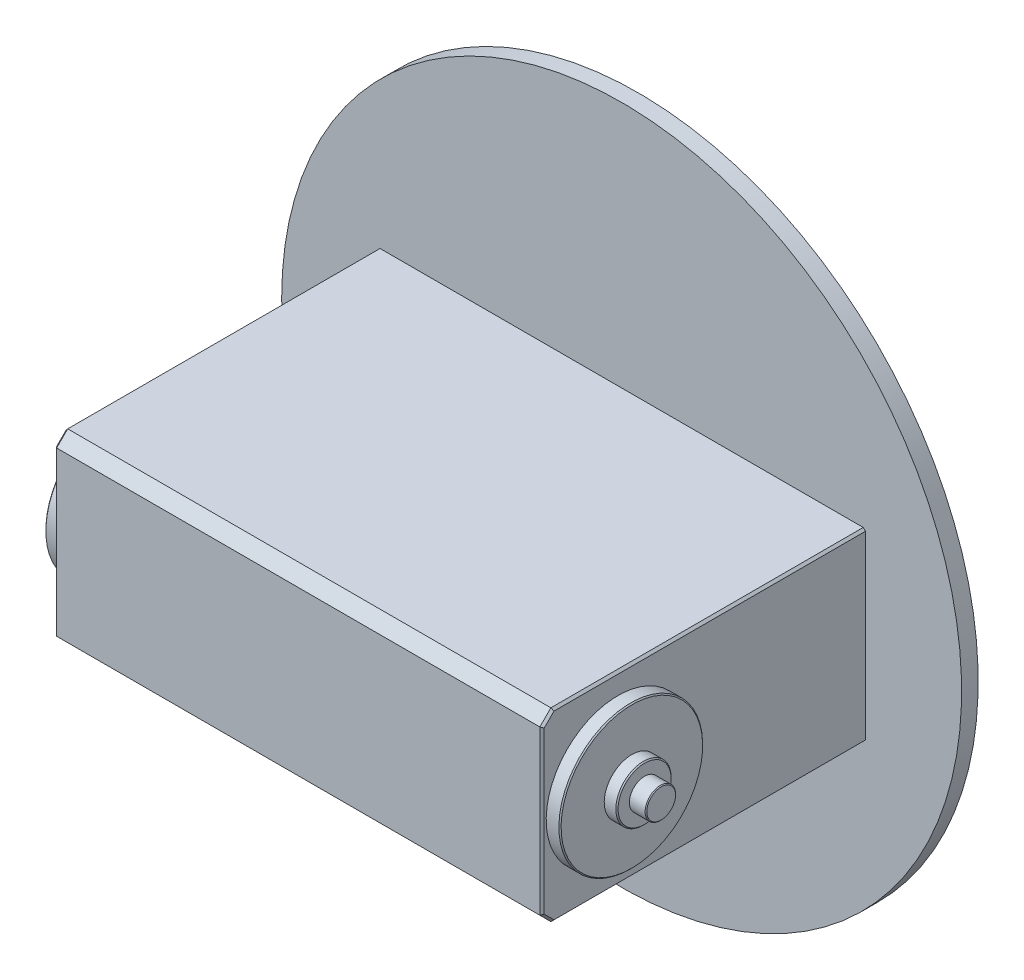
ISO-10303-21;
HEADER;
FILE_DESCRIPTION(('STEP AP214'),'2;1');
FILE_NAME('part.step','',(''),(''),'','','');
FILE_SCHEMA(('AUTOMOTIVE_DESIGN { 1 0 10303 214 1 1 1 1 }'));
ENDSEC;
DATA;
#1=APPLICATION_CONTEXT('core data for automotive mechanical design processes');
#2=APPLICATION_PROTOCOL_DEFINITION('international standard','automotive_design',2000,#1);
#3=PRODUCT_CONTEXT('',#1,'mechanical');
#4=PRODUCT('Part','Part','',(#3));
#5=PRODUCT_RELATED_PRODUCT_CATEGORY('part','',(#4));
#6=PRODUCT_DEFINITION_FORMATION('','',#4);
#7=PRODUCT_DEFINITION_CONTEXT('part definition',#1,'design');
#8=PRODUCT_DEFINITION('design','',#6,#7);
#9=PRODUCT_DEFINITION_SHAPE('','',#8);
#10=(LENGTH_UNIT() NAMED_UNIT(*) SI_UNIT(.MILLI.,.METRE.));
#11=(NAMED_UNIT(*) PLANE_ANGLE_UNIT() SI_UNIT($,.RADIAN.));
#12=(NAMED_UNIT(*) SI_UNIT($,.STERADIAN.) SOLID_ANGLE_UNIT());
#13=UNCERTAINTY_MEASURE_WITH_UNIT(LENGTH_MEASURE(1.E-05),#10,'distance_accuracy_value','');
#14=(GEOMETRIC_REPRESENTATION_CONTEXT(3) GLOBAL_UNCERTAINTY_ASSIGNED_CONTEXT((#13)) GLOBAL_UNIT_ASSIGNED_CONTEXT((#10,
#11,#12)) REPRESENTATION_CONTEXT('',''));
#15=CARTESIAN_POINT('',(0.,0.,0.));
#16=DIRECTION('',(0.,0.,1.));
#17=DIRECTION('',(1.,0.,0.));
#18=AXIS2_PLACEMENT_3D('',#15,#16,#17);
#19=CARTESIAN_POINT('',(51.8999999807476,-0.632571705411478,50.75));
#20=DIRECTION('',(1.,0.,0.));
#21=DIRECTION('',(0.,0.,-1.));
#22=AXIS2_PLACEMENT_3D('',#19,#20,#21);
#23=PLANE('',#22);
#24=CARTESIAN_POINT('',(51.8999999807825,-0.632571705411479,50.75));
#25=DIRECTION('',(-1.,0.,0.));
#26=DIRECTION('',(0.,-1.,0.));
#27=AXIS2_PLACEMENT_3D('',#24,#25,#26);
#28=CIRCLE('',#27,2.59999999991578);
#29=CARTESIAN_POINT('',(51.8999999807825,-3.23257170532726,50.75));
#30=VERTEX_POINT('',#29);
#31=EDGE_CURVE('E20',#30,#30,#28,.T.);
#32=ORIENTED_EDGE('',*,*,#31,.F.);
#33=EDGE_LOOP('',(#32));
#34=FACE_BOUND('',#33,.T.);
#35=ADVANCED_FACE('F17',(#34),#23,.T.);
#36=CARTESIAN_POINT('',(-51.9000000192529,-0.632571705412921,50.75));
#37=DIRECTION('',(-1.,0.,0.));
#38=DIRECTION('',(0.,0.,1.));
#39=AXIS2_PLACEMENT_3D('',#36,#37,#38);
#40=PLANE('',#39);
#41=CARTESIAN_POINT('',(-51.9000000192086,-0.632571705412921,50.75));
#42=DIRECTION('',(1.,0.,0.));
#43=DIRECTION('',(0.,0.,-1.));
#44=AXIS2_PLACEMENT_3D('',#41,#42,#43);
#45=CIRCLE('',#44,2.60000000008631);
#46=CARTESIAN_POINT('',(-51.9000000192086,-0.632571705412921,48.1499999999137));
#47=VERTEX_POINT('',#46);
#48=EDGE_CURVE('E163',#47,#47,#45,.T.);
#49=ORIENTED_EDGE('',*,*,#48,.F.);
#50=EDGE_LOOP('',(#49));
#51=FACE_BOUND('',#50,.T.);
#52=ADVANCED_FACE('F218',(#51),#40,.T.);
#53=CARTESIAN_POINT('',(51.7499999808137,-0.63257170541148,50.75));
#54=DIRECTION('',(-1.,0.,0.));
#55=DIRECTION('',(0.,-1.,0.));
#56=AXIS2_PLACEMENT_3D('',#53,#54,#55);
#57=CONICAL_SURFACE('',#56,2.7499999998845,0.785398163397448);
#58=ORIENTED_EDGE('',*,*,#31,.T.);
#59=EDGE_LOOP('',(#58));
#60=FACE_BOUND('',#59,.T.);
#61=CARTESIAN_POINT('',(51.749999980736,-0.63257170541148,50.75));
#62=DIRECTION('',(1.,0.,0.));
#63=DIRECTION('',(0.,1.,0.));
#64=AXIS2_PLACEMENT_3D('',#61,#62,#63);
#65=CIRCLE('',#64,2.75);
#66=CARTESIAN_POINT('',(51.749999980736,2.11742829458852,50.75));
#67=VERTEX_POINT('',#66);
#68=EDGE_CURVE('E158',#67,#67,#65,.F.);
#69=ORIENTED_EDGE('',*,*,#68,.F.);
#70=EDGE_LOOP('',(#69));
#71=FACE_BOUND('',#70,.T.);
#72=ADVANCED_FACE('F214',(#60,#71),#57,.T.);
#73=CARTESIAN_POINT('',(-51.7500000192968,-0.632571705412921,50.75));
#74=DIRECTION('',(1.,0.,0.));
#75=DIRECTION('',(0.,0.,-1.));
#76=AXIS2_PLACEMENT_3D('',#73,#74,#75);
#77=CONICAL_SURFACE('',#76,2.75000000005503,0.785398163586926);
#78=ORIENTED_EDGE('',*,*,#48,.T.);
#79=EDGE_LOOP('',(#78));
#80=FACE_BOUND('',#79,.T.);
#81=CARTESIAN_POINT('',(-51.7500000192414,-0.632571705412921,50.75));
#82=DIRECTION('',(-1.,0.,0.));
#83=DIRECTION('',(0.,0.,1.));
#84=AXIS2_PLACEMENT_3D('',#81,#82,#83);
#85=CIRCLE('',#84,2.75);
#86=CARTESIAN_POINT('',(-51.7500000192414,-0.632571705412921,53.5));
#87=VERTEX_POINT('',#86);
#88=EDGE_CURVE('E154',#87,#87,#85,.F.);
#89=ORIENTED_EDGE('',*,*,#88,.F.);
#90=EDGE_LOOP('',(#89));
#91=FACE_BOUND('',#90,.T.);
#92=ADVANCED_FACE('F362',(#80,#91),#77,.T.);
#93=CARTESIAN_POINT('',(48.8999999807476,-0.632571705411504,50.75));
#94=DIRECTION('',(1.,0.,0.));
#95=DIRECTION('',(0.,1.,0.));
#96=AXIS2_PLACEMENT_3D('',#93,#94,#95);
#97=CYLINDRICAL_SURFACE('',#96,2.75);
#98=CARTESIAN_POINT('',(48.8999999807424,-0.632571705411504,50.75));
#99=DIRECTION('',(1.,0.,0.));
#100=DIRECTION('',(0.,1.,0.));
#101=AXIS2_PLACEMENT_3D('',#98,#99,#100);
#102=CIRCLE('',#101,2.75);
#103=CARTESIAN_POINT('',(48.8999999807424,2.1174282945885,50.75));
#104=VERTEX_POINT('',#103);
#105=EDGE_CURVE('E157',#104,#104,#102,.T.);
#106=ORIENTED_EDGE('',*,*,#105,.T.);
#107=EDGE_LOOP('',(#106));
#108=FACE_BOUND('',#107,.T.);
#109=ORIENTED_EDGE('',*,*,#68,.T.);
#110=EDGE_LOOP('',(#109));
#111=FACE_BOUND('',#110,.T.);
#112=ADVANCED_FACE('F358',(#108,#111),#97,.T.);
#113=CARTESIAN_POINT('',(-48.9000000192529,-0.632571705412914,50.75));
#114=DIRECTION('',(-1.,0.,0.));
#115=DIRECTION('',(0.,0.,1.));
#116=AXIS2_PLACEMENT_3D('',#113,#114,#115);
#117=CYLINDRICAL_SURFACE('',#116,2.75);
#118=CARTESIAN_POINT('',(-48.9000000192477,-0.632571705412914,50.75));
#119=DIRECTION('',(-1.,0.,0.));
#120=DIRECTION('',(0.,0.,1.));
#121=AXIS2_PLACEMENT_3D('',#118,#119,#120);
#122=CIRCLE('',#121,2.75);
#123=CARTESIAN_POINT('',(-48.9000000192477,-0.632571705412914,53.5));
#124=VERTEX_POINT('',#123);
#125=EDGE_CURVE('E204',#124,#124,#122,.T.);
#126=ORIENTED_EDGE('',*,*,#125,.T.);
#127=EDGE_LOOP('',(#126));
#128=FACE_BOUND('',#127,.T.);
#129=ORIENTED_EDGE('',*,*,#88,.T.);
#130=EDGE_LOOP('',(#129));
#131=FACE_BOUND('',#130,.T.);
#132=ADVANCED_FACE('F354',(#128,#131),#117,.T.);
#133=CARTESIAN_POINT('',(48.8999999807476,-0.632571705411504,50.75));
#134=DIRECTION('',(-1.,0.,0.));
#135=DIRECTION('',(0.,-1.,0.));
#136=AXIS2_PLACEMENT_3D('',#133,#134,#135);
#137=PLANE('',#136);
#138=ORIENTED_EDGE('',*,*,#105,.F.);
#139=EDGE_LOOP('',(#138));
#140=FACE_BOUND('',#139,.T.);
#141=CARTESIAN_POINT('',(48.8999999807902,-0.632571705411504,50.75));
#142=DIRECTION('',(-1.,0.,0.));
#143=DIRECTION('',(0.,-1.,0.));
#144=AXIS2_PLACEMENT_3D('',#141,#142,#143);
#145=CIRCLE('',#144,4.79999999993831);
#146=CARTESIAN_POINT('',(48.8999999807902,-5.43257170534981,50.75));
#147=VERTEX_POINT('',#146);
#148=EDGE_CURVE('E201',#147,#147,#145,.T.);
#149=ORIENTED_EDGE('',*,*,#148,.F.);
#150=EDGE_LOOP('',(#149));
#151=FACE_BOUND('',#150,.T.);
#152=ADVANCED_FACE('F350',(#140,#151),#137,.F.);
#153=CARTESIAN_POINT('',(-48.9000000192529,-0.632571705412914,50.75));
#154=DIRECTION('',(1.,0.,0.));
#155=DIRECTION('',(0.,1.,0.));
#156=AXIS2_PLACEMENT_3D('',#153,#154,#155);
#157=PLANE('',#156);
#158=ORIENTED_EDGE('',*,*,#125,.F.);
#159=EDGE_LOOP('',(#158));
#160=FACE_BOUND('',#159,.T.);
#161=CARTESIAN_POINT('',(-48.9000000193364,-0.632571705412914,50.75));
#162=DIRECTION('',(1.,0.,0.));
#163=DIRECTION('',(0.,0.,-1.));
#164=AXIS2_PLACEMENT_3D('',#161,#162,#163);
#165=CIRCLE('',#164,4.79999999998881);
#166=CARTESIAN_POINT('',(-48.9000000193364,-0.632571705412914,45.9500000000112));
#167=VERTEX_POINT('',#166);
#168=EDGE_CURVE('E153',#167,#167,#165,.T.);
#169=ORIENTED_EDGE('',*,*,#168,.F.);
#170=EDGE_LOOP('',(#169));
#171=FACE_BOUND('',#170,.T.);
#172=ADVANCED_FACE('F346',(#160,#171),#157,.F.);
#173=CARTESIAN_POINT('',(48.6999999808404,-0.632571705411506,50.75));
#174=DIRECTION('',(-1.,0.,0.));
#175=DIRECTION('',(0.,-1.,0.));
#176=AXIS2_PLACEMENT_3D('',#173,#174,#175);
#177=CONICAL_SURFACE('',#176,4.99999999988814,0.785398163397431);
#178=ORIENTED_EDGE('',*,*,#148,.T.);
#179=EDGE_LOOP('',(#178));
#180=FACE_BOUND('',#179,.T.);
#181=CARTESIAN_POINT('',(48.6999999807728,-0.632571705411506,50.75));
#182=DIRECTION('',(-1.,0.,0.));
#183=DIRECTION('',(0.,-1.,0.));
#184=AXIS2_PLACEMENT_3D('',#181,#182,#183);
#185=CIRCLE('',#184,5.);
#186=CARTESIAN_POINT('',(48.6999999807729,-5.63257170541151,50.75));
#187=VERTEX_POINT('',#186);
#188=EDGE_CURVE('E150',#187,#187,#185,.T.);
#189=ORIENTED_EDGE('',*,*,#188,.F.);
#190=EDGE_LOOP('',(#189));
#191=FACE_BOUND('',#190,.T.);
#192=ADVANCED_FACE('F342',(#180,#191),#177,.T.);
#193=CARTESIAN_POINT('',(-48.7000000193803,-0.632571705412914,50.75));
#194=DIRECTION('',(1.,0.,0.));
#195=DIRECTION('',(0.,0.,-1.));
#196=AXIS2_PLACEMENT_3D('',#193,#194,#195);
#197=CONICAL_SURFACE('',#196,4.99999999994498,0.785398163397466);
#198=ORIENTED_EDGE('',*,*,#168,.T.);
#199=EDGE_LOOP('',(#198));
#200=FACE_BOUND('',#199,.T.);
#201=CARTESIAN_POINT('',(-48.7000000192781,-0.632571705412914,50.75));
#202=DIRECTION('',(1.,0.,0.));
#203=DIRECTION('',(0.,0.,-1.));
#204=AXIS2_PLACEMENT_3D('',#201,#202,#203);
#205=CIRCLE('',#204,5.);
#206=CARTESIAN_POINT('',(-48.700000019278,-0.632571705412914,45.75));
#207=VERTEX_POINT('',#206);
#208=EDGE_CURVE('E146',#207,#207,#205,.T.);
#209=ORIENTED_EDGE('',*,*,#208,.F.);
#210=EDGE_LOOP('',(#209));
#211=FACE_BOUND('',#210,.T.);
#212=ADVANCED_FACE('F338',(#200,#211),#197,.T.);
#213=CARTESIAN_POINT('',(49.3499999807476,-0.6325717054115,50.75));
#214=DIRECTION('',(-1.,0.,0.));
#215=DIRECTION('',(0.,-1.,0.));
#216=AXIS2_PLACEMENT_3D('',#213,#214,#215);
#217=CYLINDRICAL_SURFACE('',#216,5.);
#218=ORIENTED_EDGE('',*,*,#188,.T.);
#219=EDGE_LOOP('',(#218));
#220=FACE_BOUND('',#219,.T.);
#221=CARTESIAN_POINT('',(46.5999999807476,-0.632571705411523,50.75));
#222=DIRECTION('',(-1.,0.,0.));
#223=DIRECTION('',(0.,-1.,0.));
#224=AXIS2_PLACEMENT_3D('',#221,#222,#223);
#225=CIRCLE('',#224,5.);
#226=CARTESIAN_POINT('',(46.5999999807477,-5.63257170541152,50.75));
#227=VERTEX_POINT('',#226);
#228=EDGE_CURVE('E149',#227,#227,#225,.F.);
#229=ORIENTED_EDGE('',*,*,#228,.T.);
#230=EDGE_LOOP('',(#229));
#231=FACE_BOUND('',#230,.T.);
#232=ADVANCED_FACE('F334',(#220,#231),#217,.T.);
#233=CARTESIAN_POINT('',(-49.3500000192529,-0.632571705412915,50.75));
#234=DIRECTION('',(1.,0.,0.));
#235=DIRECTION('',(0.,0.,-1.));
#236=AXIS2_PLACEMENT_3D('',#233,#234,#235);
#237=CYLINDRICAL_SURFACE('',#236,5.);
#238=ORIENTED_EDGE('',*,*,#208,.T.);
#239=EDGE_LOOP('',(#238));
#240=FACE_BOUND('',#239,.T.);
#241=CARTESIAN_POINT('',(-46.6000000192729,-0.632571705412909,50.75));
#242=DIRECTION('',(1.,0.,0.));
#243=DIRECTION('',(0.,0.,-1.));
#244=AXIS2_PLACEMENT_3D('',#241,#242,#243);
#245=CIRCLE('',#244,5.);
#246=CARTESIAN_POINT('',(-46.6000000192728,-0.632571705412909,45.75));
#247=VERTEX_POINT('',#246);
#248=EDGE_CURVE('E194',#247,#247,#245,.F.);
#249=ORIENTED_EDGE('',*,*,#248,.T.);
#250=EDGE_LOOP('',(#249));
#251=FACE_BOUND('',#250,.T.);
#252=ADVANCED_FACE('F330',(#240,#251),#237,.T.);
#253=CARTESIAN_POINT('',(-1.92524396425142E-08,-0.632571705413048,0.));
#254=DIRECTION('',(0.,0.,-1.));
#255=DIRECTION('',(-1.,0.,0.));
#256=AXIS2_PLACEMENT_3D('',#253,#254,#255);
#257=PLANE('',#256);
#258=CARTESIAN_POINT('',(-1.92524368279254E-08,-0.632571705413051,0.));
#259=DIRECTION('',(0.,0.,1.));
#260=DIRECTION('',(1.,0.,0.));
#261=AXIS2_PLACEMENT_3D('',#258,#259,#260);
#262=CIRCLE('',#261,41.5);
#263=CARTESIAN_POINT('',(41.4999999807476,-0.632571705413051,0.));
#264=VERTEX_POINT('',#263);
#265=EDGE_CURVE('E191',#264,#264,#262,.T.);
#266=ORIENTED_EDGE('',*,*,#265,.F.);
#267=EDGE_LOOP('',(#266));
#268=FACE_BOUND('',#267,.T.);
#269=ADVANCED_FACE('F326',(#268),#257,.T.);
#270=CARTESIAN_POINT('',(46.5999999807476,-0.632571705411523,50.75));
#271=DIRECTION('',(-1.,0.,0.));
#272=DIRECTION('',(0.,-1.,0.));
#273=AXIS2_PLACEMENT_3D('',#270,#271,#272);
#274=PLANE('',#273);
#275=ORIENTED_EDGE('',*,*,#228,.F.);
#276=EDGE_LOOP('',(#275));
#277=FACE_BOUND('',#276,.T.);
#278=CARTESIAN_POINT('',(46.5999999807577,-0.632571705411523,50.75));
#279=DIRECTION('',(-1.,0.,0.));
#280=DIRECTION('',(0.,-1.,0.));
#281=AXIS2_PLACEMENT_3D('',#278,#279,#280);
#282=CIRCLE('',#281,12.7999999999899);
#283=CARTESIAN_POINT('',(46.5999999807578,-13.4325717054014,50.75));
#284=VERTEX_POINT('',#283);
#285=EDGE_CURVE('E188',#284,#284,#282,.T.);
#286=ORIENTED_EDGE('',*,*,#285,.F.);
#287=EDGE_LOOP('',(#286));
#288=FACE_BOUND('',#287,.T.);
#289=ADVANCED_FACE('F322',(#277,#288),#274,.F.);
#290=CARTESIAN_POINT('',(-46.6000000192529,-0.632571705412909,50.75));
#291=DIRECTION('',(1.,0.,0.));
#292=DIRECTION('',(0.,1.,0.));
#293=AXIS2_PLACEMENT_3D('',#290,#291,#292);
#294=PLANE('',#293);
#295=ORIENTED_EDGE('',*,*,#248,.F.);
#296=EDGE_LOOP('',(#295));
#297=FACE_BOUND('',#296,.T.);
#298=CARTESIAN_POINT('',(-46.6000000192629,-0.632571705412909,50.75));
#299=DIRECTION('',(1.,0.,0.));
#300=DIRECTION('',(0.,0.,-1.));
#301=AXIS2_PLACEMENT_3D('',#298,#299,#300);
#302=CIRCLE('',#301,12.79999999999);
#303=CARTESIAN_POINT('',(-46.6000000192628,-0.632571705412909,37.95000000001));
#304=VERTEX_POINT('',#303);
#305=EDGE_CURVE('E185',#304,#304,#302,.T.);
#306=ORIENTED_EDGE('',*,*,#305,.F.);
#307=EDGE_LOOP('',(#306));
#308=FACE_BOUND('',#307,.T.);
#309=ADVANCED_FACE('F318',(#297,#308),#294,.F.);
#310=CARTESIAN_POINT('',(-1.92524368279254E-08,-0.632571705413051,0.));
#311=DIRECTION('',(0.,0.,1.));
#312=DIRECTION('',(1.,0.,0.));
#313=AXIS2_PLACEMENT_3D('',#310,#311,#312);
#314=CYLINDRICAL_SURFACE('',#313,41.5);
#315=ORIENTED_EDGE('',*,*,#265,.T.);
#316=EDGE_LOOP('',(#315));
#317=FACE_BOUND('',#316,.T.);
#318=CARTESIAN_POINT('',(-1.92524368279254E-08,-0.632571705413051,3.00000011922929));
#319=DIRECTION('',(0.,0.,1.));
#320=DIRECTION('',(1.,0.,0.));
#321=AXIS2_PLACEMENT_3D('',#318,#319,#320);
#322=CIRCLE('',#321,41.5);
#323=CARTESIAN_POINT('',(41.4999999807476,-0.632571705413051,3.00000011922929));
#324=VERTEX_POINT('',#323);
#325=EDGE_CURVE('E145',#324,#324,#322,.F.);
#326=ORIENTED_EDGE('',*,*,#325,.T.);
#327=EDGE_LOOP('',(#326));
#328=FACE_BOUND('',#327,.T.);
#329=ADVANCED_FACE('F314',(#317,#328),#314,.T.);
#330=CARTESIAN_POINT('',(46.3999999807602,-0.632571705411525,50.75));
#331=DIRECTION('',(-1.,0.,0.));
#332=DIRECTION('',(0.,-1.,0.));
#333=AXIS2_PLACEMENT_3D('',#330,#331,#332);
#334=CONICAL_SURFACE('',#333,12.9999999999874,0.785398163397466);
#335=ORIENTED_EDGE('',*,*,#285,.T.);
#336=EDGE_LOOP('',(#335));
#337=FACE_BOUND('',#336,.T.);
#338=CARTESIAN_POINT('',(46.3999999807729,-0.632571705411525,50.75));
#339=DIRECTION('',(-1.,0.,0.));
#340=DIRECTION('',(0.,-1.,0.));
#341=AXIS2_PLACEMENT_3D('',#338,#339,#340);
#342=CIRCLE('',#341,13.);
#343=CARTESIAN_POINT('',(46.399999980773,-13.6325717054115,50.75));
#344=VERTEX_POINT('',#343);
#345=EDGE_CURVE('E627',#344,#344,#342,.T.);
#346=ORIENTED_EDGE('',*,*,#345,.F.);
#347=EDGE_LOOP('',(#346));
#348=FACE_BOUND('',#347,.T.);
#349=ADVANCED_FACE('F310',(#337,#348),#334,.T.);
#350=CARTESIAN_POINT('',(-0.100000019252904,-17.3825717054128,64.5));
#351=DIRECTION('',(0.,0.,1.));
#352=DIRECTION('',(0.,-1.,0.));
#353=AXIS2_PLACEMENT_3D('',#350,#351,#352);
#354=PLANE('',#353);
#355=DIRECTION('',(1.,0.,0.));
#356=VECTOR('',#355,1.);
#357=CARTESIAN_POINT('',(22.0999999807477,-15.3825717054117,64.5));
#358=LINE('',#357,#356);
#359=CARTESIAN_POINT('',(43.6999999807472,-15.3825717054115,64.4999999999998));
#360=VERTEX_POINT('',#359);
#361=CARTESIAN_POINT('',(-43.7000000192527,-15.3825717054122,64.4999999999999));
#362=VERTEX_POINT('',#361);
#363=EDGE_CURVE('E677',#360,#362,#358,.F.);
#364=ORIENTED_EDGE('',*,*,#363,.F.);
#365=DIRECTION('',(0.,1.,0.));
#366=VECTOR('',#365,1.);
#367=CARTESIAN_POINT('',(43.6999999807475,-0.63257170541157,64.5000000000001));
#368=LINE('',#367,#366);
#369=CARTESIAN_POINT('',(43.6999999807473,14.1174282945877,64.5));
#370=VERTEX_POINT('',#369);
#371=EDGE_CURVE('E137',#370,#360,#368,.F.);
#372=ORIENTED_EDGE('',*,*,#371,.F.);
#373=DIRECTION('',(1.,0.,0.));
#374=VECTOR('',#373,1.);
#375=CARTESIAN_POINT('',(-22.100000019253,14.1174282945871,64.5));
#376=LINE('',#375,#374);
#377=CARTESIAN_POINT('',(-43.7000000192527,14.1174282945876,64.4999999999998));
#378=VERTEX_POINT('',#377);
#379=EDGE_CURVE('E102',#378,#370,#376,.T.);
#380=ORIENTED_EDGE('',*,*,#379,.F.);
#381=DIRECTION('',(0.,1.,0.));
#382=VECTOR('',#381,1.);
#383=CARTESIAN_POINT('',(-43.7000000192529,-0.632571705412884,64.5));
#384=LINE('',#383,#382);
#385=EDGE_CURVE('E667',#362,#378,#384,.T.);
#386=ORIENTED_EDGE('',*,*,#385,.F.);
#387=EDGE_LOOP('',(#364,#372,#380,#386));
#388=FACE_BOUND('',#387,.T.);
#389=ADVANCED_FACE('F306',(#388),#354,.T.);
#390=CARTESIAN_POINT('',(-46.4000000192655,-0.632571705412909,50.75));
#391=DIRECTION('',(1.,0.,0.));
#392=DIRECTION('',(0.,0.,-1.));
#393=AXIS2_PLACEMENT_3D('',#390,#391,#392);
#394=CONICAL_SURFACE('',#393,12.9999999999874,0.785398163397431);
#395=ORIENTED_EDGE('',*,*,#305,.T.);
#396=EDGE_LOOP('',(#395));
#397=FACE_BOUND('',#396,.T.);
#398=CARTESIAN_POINT('',(-46.4000000192781,-0.632571705412908,50.75));
#399=DIRECTION('',(1.,0.,0.));
#400=DIRECTION('',(0.,0.,-1.));
#401=AXIS2_PLACEMENT_3D('',#398,#399,#400);
#402=CIRCLE('',#401,13.);
#403=CARTESIAN_POINT('',(-46.400000019278,-0.632571705412908,37.75));
#404=VERTEX_POINT('',#403);
#405=EDGE_CURVE('E182',#404,#404,#402,.T.);
#406=ORIENTED_EDGE('',*,*,#405,.F.);
#407=EDGE_LOOP('',(#406));
#408=FACE_BOUND('',#407,.T.);
#409=ADVANCED_FACE('F302',(#397,#408),#394,.T.);
#410=CARTESIAN_POINT('',(-1.92524401629313E-08,-0.632571705413051,3.00000011920929));
#411=DIRECTION('',(0.,0.,1.));
#412=DIRECTION('',(0.,-1.,0.));
#413=AXIS2_PLACEMENT_3D('',#410,#411,#412);
#414=PLANE('',#413);
#415=ORIENTED_EDGE('',*,*,#325,.F.);
#416=EDGE_LOOP('',(#415));
#417=FACE_BOUND('',#416,.T.);
#418=CARTESIAN_POINT('',(-1.92524368322622E-08,-0.632571705413051,3.00000023841334));
#419=DIRECTION('',(0.,0.,-1.));
#420=DIRECTION('',(-1.,0.,0.));
#421=AXIS2_PLACEMENT_3D('',#418,#419,#420);
#422=CIRCLE('',#421,61.5000009164216);
#423=CARTESIAN_POINT('',(-61.500000935674,-0.632571705413051,3.00000023841334));
#424=VERTEX_POINT('',#423);
#425=EDGE_CURVE('E179',#424,#424,#422,.F.);
#426=ORIENTED_EDGE('',*,*,#425,.F.);
#427=EDGE_LOOP('',(#426));
#428=FACE_BOUND('',#427,.T.);
#429=ADVANCED_FACE('F299',(#417,#428),#414,.F.);
#430=CARTESIAN_POINT('',(-22.100000019253,15.1174282945871,63.5));
#431=DIRECTION('',(0.,0.707106781186547,0.707106781186548));
#432=DIRECTION('',(0.,-0.707106781186548,0.707106781186547));
#433=AXIS2_PLACEMENT_3D('',#430,#431,#432);
#434=PLANE('',#433);
#435=DIRECTION('',(0.,-0.707106781186547,0.707106781186548));
#436=VECTOR('',#435,1.);
#437=CARTESIAN_POINT('',(43.6999999807456,16.1174282945871,62.4999999999987));
#438=LINE('',#437,#436);
#439=CARTESIAN_POINT('',(43.6999999807435,16.1174282945905,62.5000000000005));
#440=VERTEX_POINT('',#439);
#441=EDGE_CURVE('E106',#440,#370,#438,.T.);
#442=ORIENTED_EDGE('',*,*,#441,.F.);
#443=DIRECTION('',(1.,0.,0.));
#444=VECTOR('',#443,1.);
#445=CARTESIAN_POINT('',(-0.100000019252979,16.1174282945872,62.5));
#446=LINE('',#445,#444);
#447=CARTESIAN_POINT('',(-43.7000000192532,16.1174282945865,62.4999999999992));
#448=VERTEX_POINT('',#447);
#449=EDGE_CURVE('E109',#448,#440,#446,.T.);
#450=ORIENTED_EDGE('',*,*,#449,.F.);
#451=DIRECTION('',(0.,0.707106781186547,-0.707106781186548));
#452=VECTOR('',#451,1.);
#453=CARTESIAN_POINT('',(-43.7000000192511,14.1174282945858,64.4999999999986));
#454=LINE('',#453,#452);
#455=EDGE_CURVE('E659',#378,#448,#454,.T.);
#456=ORIENTED_EDGE('',*,*,#455,.F.);
#457=ORIENTED_EDGE('',*,*,#379,.T.);
#458=EDGE_LOOP('',(#442,#450,#456,#457));
#459=FACE_BOUND('',#458,.T.);
#460=ADVANCED_FACE('F108',(#459),#434,.T.);
#461=CARTESIAN_POINT('',(43.8999999807476,15.9174282945885,35.25));
#462=DIRECTION('',(0.707106781186542,0.707106781186554,0.));
#463=DIRECTION('',(-0.707106781186554,0.707106781186542,0.));
#464=AXIS2_PLACEMENT_3D('',#461,#462,#463);
#465=PLANE('',#464);
#466=DIRECTION('',(0.,0.,-1.));
#467=VECTOR('',#466,1.);
#468=CARTESIAN_POINT('',(44.0999995800257,15.7174282954539,35.25));
#469=LINE('',#468,#467);
#470=CARTESIAN_POINT('',(44.0999998802269,15.7174282952758,5.99999997020085));
#471=VERTEX_POINT('',#470);
#472=CARTESIAN_POINT('',(44.0999998801832,15.7174282951897,62.3343145752197));
#473=VERTEX_POINT('',#472);
#474=EDGE_CURVE('E131',#471,#473,#469,.F.);
#475=ORIENTED_EDGE('',*,*,#474,.F.);
#476=DIRECTION('',(-0.707106781186554,0.707106781186542,0.));
#477=VECTOR('',#476,1.);
#478=CARTESIAN_POINT('',(43.8999999807477,15.9174282945886,6.00000000000978));
#479=LINE('',#478,#477);
#480=CARTESIAN_POINT('',(43.6999999807449,16.1174282946024,5.99999997009476));
#481=VERTEX_POINT('',#480);
#482=EDGE_CURVE('E115',#471,#481,#479,.T.);
#483=ORIENTED_EDGE('',*,*,#482,.T.);
#484=DIRECTION('',(0.,0.,1.));
#485=VECTOR('',#484,1.);
#486=CARTESIAN_POINT('',(43.6999999807474,16.1174282945872,64.5));
#487=LINE('',#486,#485);
#488=EDGE_CURVE('E122',#440,#481,#487,.F.);
#489=ORIENTED_EDGE('',*,*,#488,.F.);
#490=DIRECTION('',(-0.678598344549199,0.678598344536833,0.281084637728489));
#491=VECTOR('',#490,1.);
#492=CARTESIAN_POINT('',(44.0999999802302,15.7174282951098,62.3343145752557));
#493=LINE('',#492,#491);
#494=EDGE_CURVE('E114',#473,#440,#493,.T.);
#495=ORIENTED_EDGE('',*,*,#494,.F.);
#496=EDGE_LOOP('',(#475,#483,#489,#495));
#497=FACE_BOUND('',#496,.T.);
#498=ADVANCED_FACE('F129',(#497),#465,.T.);
#499=CARTESIAN_POINT('',(43.8999999807474,14.9760069383485,63.3585786437602));
#500=DIRECTION('',(0.707106781186517,0.500000000000023,0.500000000000021));
#501=DIRECTION('',(-0.57735026918966,0.816496580927702,0.));
#502=AXIS2_PLACEMENT_3D('',#499,#500,#501);
#503=PLANE('',#502);
#504=DIRECTION('',(0.,-0.707106781183343,0.707106781189751));
#505=VECTOR('',#504,1.);
#506=CARTESIAN_POINT('',(44.0999995800255,15.7174282951598,62.3343145753057));
#507=LINE('',#506,#505);
#508=CARTESIAN_POINT('',(44.0999998801818,13.9517428698565,64.1000000005443));
#509=VERTEX_POINT('',#508);
#510=EDGE_CURVE('E135',#473,#509,#507,.T.);
#511=ORIENTED_EDGE('',*,*,#510,.F.);
#512=ORIENTED_EDGE('',*,*,#494,.T.);
#513=ORIENTED_EDGE('',*,*,#441,.T.);
#514=DIRECTION('',(-0.678598344557376,0.28108463765918,0.678598344557365));
#515=VECTOR('',#514,1.);
#516=CARTESIAN_POINT('',(44.099999980236,13.9517428698866,64.1000000005114));
#517=LINE('',#516,#515);
#518=EDGE_CURVE('E139',#509,#370,#517,.T.);
#519=ORIENTED_EDGE('',*,*,#518,.F.);
#520=EDGE_LOOP('',(#511,#512,#513,#519));
#521=FACE_BOUND('',#520,.T.);
#522=ADVANCED_FACE('F133',(#521),#503,.T.);
#523=CARTESIAN_POINT('',(43.8999999807476,-0.63257170541157,64.3));
#524=DIRECTION('',(0.707106781186544,0.,0.707106781186552));
#525=DIRECTION('',(0.707106781186552,0.,-0.707106781186544));
#526=AXIS2_PLACEMENT_3D('',#523,#524,#525);
#527=PLANE('',#526);
#528=DIRECTION('',(0.,1.,0.));
#529=VECTOR('',#528,1.);
#530=CARTESIAN_POINT('',(44.0999995800255,-0.632571705411539,64.1000000005949));
#531=LINE('',#530,#529);
#532=CARTESIAN_POINT('',(44.0999998801822,-15.2168862806927,64.1000000005411));
#533=VERTEX_POINT('',#532);
#534=EDGE_CURVE('E639',#509,#533,#531,.F.);
#535=ORIENTED_EDGE('',*,*,#534,.F.);
#536=ORIENTED_EDGE('',*,*,#518,.T.);
#537=ORIENTED_EDGE('',*,*,#371,.T.);
#538=DIRECTION('',(-0.67859834456075,-0.281084637776152,0.67859834450554));
#539=VECTOR('',#538,1.);
#540=CARTESIAN_POINT('',(44.099999980235,-15.2168862806401,64.100000000542));
#541=LINE('',#540,#539);
#542=EDGE_CURVE('E629',#533,#360,#541,.T.);
#543=ORIENTED_EDGE('',*,*,#542,.F.);
#544=EDGE_LOOP('',(#535,#536,#537,#543));
#545=FACE_BOUND('',#544,.T.);
#546=ADVANCED_FACE('F288',(#545),#527,.T.);
#547=CARTESIAN_POINT('',(43.8999999807477,-16.2411503491715,63.3585786437602));
#548=DIRECTION('',(0.707106781186525,-0.500000000000011,0.500000000000021));
#549=DIRECTION('',(0.577350269189654,0.,-0.816496580927706));
#550=AXIS2_PLACEMENT_3D('',#547,#548,#549);
#551=PLANE('',#550);
#552=DIRECTION('',(0.,-0.707106781186547,-0.707106781186548));
#553=VECTOR('',#552,1.);
#554=CARTESIAN_POINT('',(43.6999999807477,-16.3825717054117,63.5));
#555=LINE('',#554,#553);
#556=CARTESIAN_POINT('',(43.699999980749,-17.382571705411,62.4999999999993));
#557=VERTEX_POINT('',#556);
#558=EDGE_CURVE('E679',#557,#360,#555,.F.);
#559=ORIENTED_EDGE('',*,*,#558,.F.);
#560=DIRECTION('',(-0.678598344557408,-0.678598344557413,0.281084637658987));
#561=VECTOR('',#560,1.);
#562=CARTESIAN_POINT('',(44.0999999802363,-16.9825717059229,62.3343145752983));
#563=LINE('',#562,#561);
#564=CARTESIAN_POINT('',(44.0999998801718,-16.9825717059659,62.3343145752725));
#565=VERTEX_POINT('',#564);
#566=EDGE_CURVE('E628',#565,#557,#563,.T.);
#567=ORIENTED_EDGE('',*,*,#566,.F.);
#568=DIRECTION('',(0.,-0.707106781184724,-0.707106781188371));
#569=VECTOR('',#568,1.);
#570=CARTESIAN_POINT('',(44.0999995800255,-15.2168862807059,64.1000000006078));
#571=LINE('',#570,#569);
#572=EDGE_CURVE('E643',#533,#565,#571,.T.);
#573=ORIENTED_EDGE('',*,*,#572,.F.);
#574=ORIENTED_EDGE('',*,*,#542,.T.);
#575=EDGE_LOOP('',(#559,#567,#573,#574));
#576=FACE_BOUND('',#575,.T.);
#577=ADVANCED_FACE('F284',(#576),#551,.T.);
#578=CARTESIAN_POINT('',(49.3499999807476,-0.6325717054115,50.75));
#579=DIRECTION('',(-1.,0.,0.));
#580=DIRECTION('',(0.,-1.,0.));
#581=AXIS2_PLACEMENT_3D('',#578,#579,#580);
#582=CYLINDRICAL_SURFACE('',#581,13.);
#583=ORIENTED_EDGE('',*,*,#345,.T.);
#584=EDGE_LOOP('',(#583));
#585=FACE_BOUND('',#584,.T.);
#586=CARTESIAN_POINT('',(44.0999995800204,-0.632571705411545,50.75));
#587=DIRECTION('',(-1.,0.,0.));
#588=DIRECTION('',(0.,-1.,0.));
#589=AXIS2_PLACEMENT_3D('',#586,#587,#588);
#590=CIRCLE('',#589,13.);
#591=CARTESIAN_POINT('',(44.0999995800205,-13.6325717054115,50.75));
#592=VERTEX_POINT('',#591);
#593=EDGE_CURVE('E174',#592,#592,#590,.T.);
#594=ORIENTED_EDGE('',*,*,#593,.F.);
#595=EDGE_LOOP('',(#594));
#596=FACE_BOUND('',#595,.T.);
#597=ADVANCED_FACE('F280',(#585,#596),#582,.T.);
#598=CARTESIAN_POINT('',(43.8999999807479,-17.1825717054115,35.25));
#599=DIRECTION('',(0.707106781186554,-0.707106781186542,0.));
#600=DIRECTION('',(0.707106781186542,0.707106781186554,0.));
#601=AXIS2_PLACEMENT_3D('',#598,#599,#600);
#602=PLANE('',#601);
#603=DIRECTION('',(0.,0.,1.));
#604=VECTOR('',#603,1.);
#605=CARTESIAN_POINT('',(43.699999980766,-17.3825717054115,64.5));
#606=LINE('',#605,#604);
#607=CARTESIAN_POINT('',(43.6999999807569,-17.3825717054127,5.99999996983045));
#608=VERTEX_POINT('',#607);
#609=EDGE_CURVE('E177',#608,#557,#606,.T.);
#610=ORIENTED_EDGE('',*,*,#609,.F.);
#611=DIRECTION('',(0.707106781186542,0.707106781186554,0.));
#612=VECTOR('',#611,1.);
#613=CARTESIAN_POINT('',(43.899999980748,-17.1825717054116,5.99999999952494));
#614=LINE('',#613,#612);
#615=CARTESIAN_POINT('',(44.0999998802044,-16.9825717060518,5.99999996995843));
#616=VERTEX_POINT('',#615);
#617=EDGE_CURVE('E632',#608,#616,#614,.T.);
#618=ORIENTED_EDGE('',*,*,#617,.T.);
#619=DIRECTION('',(0.,0.,-1.));
#620=VECTOR('',#619,1.);
#621=CARTESIAN_POINT('',(44.0999995800257,-16.9825717060063,35.25));
#622=LINE('',#621,#620);
#623=EDGE_CURVE('E178',#565,#616,#622,.T.);
#624=ORIENTED_EDGE('',*,*,#623,.F.);
#625=ORIENTED_EDGE('',*,*,#566,.T.);
#626=EDGE_LOOP('',(#610,#618,#624,#625));
#627=FACE_BOUND('',#626,.T.);
#628=ADVANCED_FACE('F276',(#627),#602,.T.);
#629=CARTESIAN_POINT('',(22.0999999807477,-16.3825717054117,63.5));
#630=DIRECTION('',(0.,-0.707106781186548,0.707106781186547));
#631=DIRECTION('',(0.,-0.707106781186547,-0.707106781186548));
#632=AXIS2_PLACEMENT_3D('',#629,#630,#631);
#633=PLANE('',#632);
#634=DIRECTION('',(0.,0.707106781186545,0.70710678118655));
#635=VECTOR('',#634,1.);
#636=CARTESIAN_POINT('',(-43.700000019251,-17.3825717054115,62.4999999999986));
#637=LINE('',#636,#635);
#638=CARTESIAN_POINT('',(-43.7000000192489,-17.3825717054151,62.5000000000005));
#639=VERTEX_POINT('',#638);
#640=EDGE_CURVE('E673',#639,#362,#637,.T.);
#641=ORIENTED_EDGE('',*,*,#640,.F.);
#642=DIRECTION('',(1.,0.,0.));
#643=VECTOR('',#642,1.);
#644=CARTESIAN_POINT('',(0.0999999807476781,-17.3825717054119,62.5));
#645=LINE('',#644,#643);
#646=EDGE_CURVE('E709',#557,#639,#645,.F.);
#647=ORIENTED_EDGE('',*,*,#646,.F.);
#648=ORIENTED_EDGE('',*,*,#558,.T.);
#649=ORIENTED_EDGE('',*,*,#363,.T.);
#650=EDGE_LOOP('',(#641,#647,#648,#649));
#651=FACE_BOUND('',#650,.T.);
#652=ADVANCED_FACE('F272',(#651),#633,.T.);
#653=CARTESIAN_POINT('',(-44.0999999807473,-16.9825717054123,5.99999999999967));
#654=DIRECTION('',(-0.707106815221291,-0.707106747151802,0.));
#655=DIRECTION('',(0.707106747151802,-0.707106815221291,0.));
#656=AXIS2_PLACEMENT_3D('',#653,#654,#655);
#657=PLANE('',#656);
#658=DIRECTION('',(0.,0.,1.));
#659=VECTOR('',#658,1.);
#660=CARTESIAN_POINT('',(-44.0999999807474,-16.982571705422,35.25));
#661=LINE('',#660,#659);
#662=CARTESIAN_POINT('',(-44.099999980759,-16.982571705408,5.99999996984516));
#663=VERTEX_POINT('',#662);
#664=CARTESIAN_POINT('',(-44.0999999850778,-16.9825717088889,62.3343145866012));
#665=VERTEX_POINT('',#664);
#666=EDGE_CURVE('E703',#663,#665,#661,.T.);
#667=ORIENTED_EDGE('',*,*,#666,.F.);
#668=DIRECTION('',(0.707106747151802,-0.707106815221291,0.));
#669=VECTOR('',#668,1.);
#670=CARTESIAN_POINT('',(-44.0999999807473,-16.9825717054123,5.99999999952445));
#671=LINE('',#670,#669);
#672=CARTESIAN_POINT('',(-43.7000000192512,-17.3825717054256,5.9999999698302));
#673=VERTEX_POINT('',#672);
#674=EDGE_CURVE('E34',#663,#673,#671,.T.);
#675=ORIENTED_EDGE('',*,*,#674,.T.);
#676=DIRECTION('',(0.,0.,1.));
#677=VECTOR('',#676,1.);
#678=CARTESIAN_POINT('',(-43.7000000192529,-17.3825717054123,64.5));
#679=LINE('',#678,#677);
#680=EDGE_CURVE('E706',#639,#673,#679,.F.);
#681=ORIENTED_EDGE('',*,*,#680,.F.);
#682=DIRECTION('',(0.678598341211999,-0.678598353570982,0.28108462397484));
#683=VECTOR('',#682,1.);
#684=CARTESIAN_POINT('',(-44.0999999980321,-16.9825717193454,62.3343145911236));
#685=LINE('',#684,#683);
#686=EDGE_CURVE('E670',#665,#639,#685,.T.);
#687=ORIENTED_EDGE('',*,*,#686,.F.);
#688=EDGE_LOOP('',(#667,#675,#681,#687));
#689=FACE_BOUND('',#688,.T.);
#690=ADVANCED_FACE('F268',(#689),#657,.T.);
#691=CARTESIAN_POINT('',(-43.9000000192529,-16.2411503491729,63.35857864376));
#692=DIRECTION('',(-0.707106781186525,-0.500000000000019,0.500000000000013));
#693=DIRECTION('',(0.577350269189653,-0.816496580927707,0.));
#694=AXIS2_PLACEMENT_3D('',#691,#692,#693);
#695=PLANE('',#694);
#696=DIRECTION('',(0.,0.707106780887676,0.707106781485419));
#697=VECTOR('',#696,1.);
#698=CARTESIAN_POINT('',(-44.0999999807475,-16.9825717113421,62.3343145831203));
#699=LINE('',#698,#697);
#700=CARTESIAN_POINT('',(-44.0999999958912,-15.2168862876008,64.1000000153954));
#701=VERTEX_POINT('',#700);
#702=EDGE_CURVE('E700',#665,#701,#699,.T.);
#703=ORIENTED_EDGE('',*,*,#702,.F.);
#704=ORIENTED_EDGE('',*,*,#686,.T.);
#705=ORIENTED_EDGE('',*,*,#640,.T.);
#706=DIRECTION('',(0.678598343559122,-0.281084642479093,0.678598343559146));
#707=VECTOR('',#706,1.);
#708=CARTESIAN_POINT('',(-44.10000000094,-15.2168862849999,64.1000000183129));
#709=LINE('',#708,#707);
#710=EDGE_CURVE('E664',#701,#362,#709,.T.);
#711=ORIENTED_EDGE('',*,*,#710,.F.);
#712=EDGE_LOOP('',(#703,#704,#705,#711));
#713=FACE_BOUND('',#712,.T.);
#714=ADVANCED_FACE('F264',(#713),#695,.T.);
#715=CARTESIAN_POINT('',(-43.9000000192529,-0.632571705412884,64.3));
#716=DIRECTION('',(-0.707106781186552,0.,0.707106781186544));
#717=DIRECTION('',(0.707106781186544,0.,0.707106781186552));
#718=AXIS2_PLACEMENT_3D('',#715,#716,#717);
#719=PLANE('',#718);
#720=DIRECTION('',(0.,-1.,0.));
#721=VECTOR('',#720,1.);
#722=CARTESIAN_POINT('',(-44.0999999807477,-0.632571705412295,64.1000000109551));
#723=LINE('',#722,#721);
#724=CARTESIAN_POINT('',(-44.0999999958916,13.9517428754755,64.1000000159343));
#725=VERTEX_POINT('',#724);
#726=EDGE_CURVE('E697',#701,#725,#723,.F.);
#727=ORIENTED_EDGE('',*,*,#726,.F.);
#728=ORIENTED_EDGE('',*,*,#710,.T.);
#729=ORIENTED_EDGE('',*,*,#385,.T.);
#730=DIRECTION('',(0.678598343559755,0.28108463365071,0.678598347215348));
#731=VECTOR('',#730,1.);
#732=CARTESIAN_POINT('',(-44.1000000009385,13.9517428793767,64.1000000161565));
#733=LINE('',#732,#731);
#734=EDGE_CURVE('E661',#725,#378,#733,.T.);
#735=ORIENTED_EDGE('',*,*,#734,.F.);
#736=EDGE_LOOP('',(#727,#728,#729,#735));
#737=FACE_BOUND('',#736,.T.);
#738=ADVANCED_FACE('F260',(#737),#719,.T.);
#739=CARTESIAN_POINT('',(-43.900000019253,14.9760069383471,63.35857864376));
#740=DIRECTION('',(-0.707106781186528,0.500000000000015,0.500000000000013));
#741=DIRECTION('',(-0.577350269189648,-0.81649658092771,0.));
#742=AXIS2_PLACEMENT_3D('',#739,#740,#741);
#743=PLANE('',#742);
#744=ORIENTED_EDGE('',*,*,#455,.T.);
#745=DIRECTION('',(0.678598311920113,0.678598377242862,0.281084637542728));
#746=VECTOR('',#745,1.);
#747=CARTESIAN_POINT('',(-44.0999999807853,15.7174282945503,62.3343145831202));
#748=LINE('',#747,#746);
#749=CARTESIAN_POINT('',(-44.099999989399,15.7174283030105,62.3343145871292));
#750=VERTEX_POINT('',#749);
#751=EDGE_CURVE('E656',#750,#448,#748,.T.);
#752=ORIENTED_EDGE('',*,*,#751,.F.);
#753=DIRECTION('',(0.,0.707106780880165,-0.70710678149293));
#754=VECTOR('',#753,1.);
#755=CARTESIAN_POINT('',(-44.0999999807478,13.9517428741751,64.1000000109549));
#756=LINE('',#755,#754);
#757=EDGE_CURVE('E694',#725,#750,#756,.T.);
#758=ORIENTED_EDGE('',*,*,#757,.F.);
#759=ORIENTED_EDGE('',*,*,#734,.T.);
#760=EDGE_LOOP('',(#744,#752,#758,#759));
#761=FACE_BOUND('',#760,.T.);
#762=ADVANCED_FACE('F256',(#761),#743,.T.);
#763=CARTESIAN_POINT('',(-43.7000000192527,16.1174282945871,5.99999999999967));
#764=DIRECTION('',(-0.707106815220049,0.707106747153044,0.));
#765=DIRECTION('',(-0.707106747153044,-0.707106815220049,0.));
#766=AXIS2_PLACEMENT_3D('',#763,#764,#765);
#767=PLANE('',#766);
#768=DIRECTION('',(0.,0.,1.));
#769=VECTOR('',#768,1.);
#770=CARTESIAN_POINT('',(-43.7000000192624,16.1174282945872,64.5));
#771=LINE('',#770,#769);
#772=CARTESIAN_POINT('',(-43.7000000192576,16.1174282945896,5.99999996985237));
#773=VERTEX_POINT('',#772);
#774=EDGE_CURVE('E125',#773,#448,#771,.T.);
#775=ORIENTED_EDGE('',*,*,#774,.F.);
#776=DIRECTION('',(-0.707106747153044,-0.707106815220049,0.));
#777=VECTOR('',#776,1.);
#778=CARTESIAN_POINT('',(-43.7000000192527,16.1174282945871,5.99999999952501));
#779=LINE('',#778,#777);
#780=CARTESIAN_POINT('',(-44.0999999807546,15.717428296061,5.99999996984544));
#781=VERTEX_POINT('',#780);
#782=EDGE_CURVE('E654',#773,#781,#779,.T.);
#783=ORIENTED_EDGE('',*,*,#782,.T.);
#784=DIRECTION('',(0.,0.,1.));
#785=VECTOR('',#784,1.);
#786=CARTESIAN_POINT('',(-44.0999999807476,15.7174283004797,35.25));
#787=LINE('',#786,#785);
#788=EDGE_CURVE('E173',#750,#781,#787,.F.);
#789=ORIENTED_EDGE('',*,*,#788,.F.);
#790=ORIENTED_EDGE('',*,*,#751,.T.);
#791=EDGE_LOOP('',(#775,#783,#789,#790));
#792=FACE_BOUND('',#791,.T.);
#793=ADVANCED_FACE('F252',(#792),#767,.T.);
#794=CARTESIAN_POINT('',(-49.3500000192529,-0.632571705412915,50.75));
#795=DIRECTION('',(1.,0.,0.));
#796=DIRECTION('',(0.,0.,-1.));
#797=AXIS2_PLACEMENT_3D('',#794,#795,#796);
#798=CYLINDRICAL_SURFACE('',#797,13.);
#799=ORIENTED_EDGE('',*,*,#405,.T.);
#800=EDGE_LOOP('',(#799));
#801=FACE_BOUND('',#800,.T.);
#802=CARTESIAN_POINT('',(-44.0999999807423,-0.632571705412903,50.75));
#803=DIRECTION('',(1.,0.,0.));
#804=DIRECTION('',(0.,0.,-1.));
#805=AXIS2_PLACEMENT_3D('',#802,#803,#804);
#806=CIRCLE('',#805,13.);
#807=CARTESIAN_POINT('',(-44.0999999807423,-0.632571705412903,37.75));
#808=VERTEX_POINT('',#807);
#809=EDGE_CURVE('E170',#808,#808,#806,.T.);
#810=ORIENTED_EDGE('',*,*,#809,.F.);
#811=EDGE_LOOP('',(#810));
#812=FACE_BOUND('',#811,.T.);
#813=ADVANCED_FACE('F248',(#801,#812),#798,.T.);
#814=CARTESIAN_POINT('',(-1.92524368322622E-08,-0.632571705413051,6.));
#815=DIRECTION('',(0.,0.,-1.));
#816=DIRECTION('',(-1.,0.,0.));
#817=AXIS2_PLACEMENT_3D('',#814,#815,#816);
#818=CYLINDRICAL_SURFACE('',#817,61.5000009164216);
#819=CARTESIAN_POINT('',(-1.92524368322622E-08,-0.632571705413051,6.00000000002523));
#820=DIRECTION('',(0.,0.,-1.));
#821=DIRECTION('',(-1.,0.,0.));
#822=AXIS2_PLACEMENT_3D('',#819,#820,#821);
#823=CIRCLE('',#822,61.5000009164216);
#824=CARTESIAN_POINT('',(-61.500000935674,-0.632571705413051,6.00000000002523));
#825=VERTEX_POINT('',#824);
#826=EDGE_CURVE('E166',#825,#825,#823,.F.);
#827=ORIENTED_EDGE('',*,*,#826,.F.);
#828=EDGE_LOOP('',(#827));
#829=FACE_BOUND('',#828,.T.);
#830=ORIENTED_EDGE('',*,*,#425,.T.);
#831=EDGE_LOOP('',(#830));
#832=FACE_BOUND('',#831,.T.);
#833=ADVANCED_FACE('F245',(#829,#832),#818,.T.);
#834=CARTESIAN_POINT('',(-0.100000019252979,16.1174282945872,64.5));
#835=DIRECTION('',(0.,1.,0.));
#836=DIRECTION('',(0.,0.,1.));
#837=AXIS2_PLACEMENT_3D('',#834,#835,#836);
#838=PLANE('',#837);
#839=ORIENTED_EDGE('',*,*,#488,.T.);
#840=DIRECTION('',(1.,0.,0.));
#841=VECTOR('',#840,1.);
#842=CARTESIAN_POINT('',(-1.92524401629313E-08,16.1174282945972,5.99999988079071));
#843=LINE('',#842,#841);
#844=EDGE_CURVE('E169',#773,#481,#843,.T.);
#845=ORIENTED_EDGE('',*,*,#844,.F.);
#846=ORIENTED_EDGE('',*,*,#774,.T.);
#847=ORIENTED_EDGE('',*,*,#449,.T.);
#848=EDGE_LOOP('',(#839,#845,#846,#847));
#849=FACE_BOUND('',#848,.T.);
#850=ADVANCED_FACE('F120',(#849),#838,.T.);
#851=CARTESIAN_POINT('',(44.0999995800257,-0.632571705411539,35.25));
#852=DIRECTION('',(1.,0.,0.));
#853=DIRECTION('',(0.,0.,-1.));
#854=AXIS2_PLACEMENT_3D('',#851,#852,#853);
#855=PLANE('',#854);
#856=ORIENTED_EDGE('',*,*,#593,.T.);
#857=EDGE_LOOP('',(#856));
#858=FACE_BOUND('',#857,.T.);
#859=ORIENTED_EDGE('',*,*,#623,.T.);
#860=DIRECTION('',(0.,-1.,0.));
#861=VECTOR('',#860,1.);
#862=CARTESIAN_POINT('',(44.0999999804046,-0.632571705413051,5.99999988079071));
#863=LINE('',#862,#861);
#864=EDGE_CURVE('E686',#471,#616,#863,.T.);
#865=ORIENTED_EDGE('',*,*,#864,.F.);
#866=ORIENTED_EDGE('',*,*,#474,.T.);
#867=ORIENTED_EDGE('',*,*,#510,.T.);
#868=ORIENTED_EDGE('',*,*,#534,.T.);
#869=ORIENTED_EDGE('',*,*,#572,.T.);
#870=EDGE_LOOP('',(#859,#865,#866,#867,#868,#869));
#871=FACE_BOUND('',#870,.T.);
#872=ADVANCED_FACE('F238',(#858,#871),#855,.T.);
#873=CARTESIAN_POINT('',(0.0999999807476781,-17.3825717054119,64.5));
#874=DIRECTION('',(0.,-1.,0.));
#875=DIRECTION('',(1.,0.,0.));
#876=AXIS2_PLACEMENT_3D('',#873,#874,#875);
#877=PLANE('',#876);
#878=ORIENTED_EDGE('',*,*,#680,.T.);
#879=DIRECTION('',(1.,0.,0.));
#880=VECTOR('',#879,1.);
#881=CARTESIAN_POINT('',(-1.92524401629313E-08,-17.382571705416,5.99999988079071));
#882=LINE('',#881,#880);
#883=EDGE_CURVE('E26',#608,#673,#882,.F.);
#884=ORIENTED_EDGE('',*,*,#883,.F.);
#885=ORIENTED_EDGE('',*,*,#609,.T.);
#886=ORIENTED_EDGE('',*,*,#646,.T.);
#887=EDGE_LOOP('',(#878,#884,#885,#886));
#888=FACE_BOUND('',#887,.T.);
#889=ADVANCED_FACE('F231',(#888),#877,.T.);
#890=CARTESIAN_POINT('',(-44.0999999807475,-0.632571705412295,35.25));
#891=DIRECTION('',(-1.,0.,0.));
#892=DIRECTION('',(0.,-1.,0.));
#893=AXIS2_PLACEMENT_3D('',#890,#891,#892);
#894=PLANE('',#893);
#895=ORIENTED_EDGE('',*,*,#809,.T.);
#896=EDGE_LOOP('',(#895));
#897=FACE_BOUND('',#896,.T.);
#898=ORIENTED_EDGE('',*,*,#788,.T.);
#899=DIRECTION('',(0.,-1.,0.));
#900=VECTOR('',#899,1.);
#901=CARTESIAN_POINT('',(-44.0999999807574,-0.632571705413051,5.99999988079071));
#902=LINE('',#901,#900);
#903=EDGE_CURVE('E11',#663,#781,#902,.F.);
#904=ORIENTED_EDGE('',*,*,#903,.F.);
#905=ORIENTED_EDGE('',*,*,#666,.T.);
#906=ORIENTED_EDGE('',*,*,#702,.T.);
#907=ORIENTED_EDGE('',*,*,#726,.T.);
#908=ORIENTED_EDGE('',*,*,#757,.T.);
#909=EDGE_LOOP('',(#898,#904,#905,#906,#907,#908));
#910=FACE_BOUND('',#909,.T.);
#911=ADVANCED_FACE('F226',(#897,#910),#894,.T.);
#912=CARTESIAN_POINT('',(-1.92524401629313E-08,-0.632571705413051,5.99999988079071));
#913=DIRECTION('',(0.,0.,1.));
#914=DIRECTION('',(0.,-1.,0.));
#915=AXIS2_PLACEMENT_3D('',#912,#913,#914);
#916=PLANE('',#915);
#917=ORIENTED_EDGE('',*,*,#674,.F.);
#918=ORIENTED_EDGE('',*,*,#903,.T.);
#919=ORIENTED_EDGE('',*,*,#782,.F.);
#920=ORIENTED_EDGE('',*,*,#844,.T.);
#921=ORIENTED_EDGE('',*,*,#482,.F.);
#922=ORIENTED_EDGE('',*,*,#864,.T.);
#923=ORIENTED_EDGE('',*,*,#617,.F.);
#924=ORIENTED_EDGE('',*,*,#883,.T.);
#925=EDGE_LOOP('',(#917,#918,#919,#920,#921,#922,#923,#924));
#926=FACE_BOUND('',#925,.T.);
#927=ORIENTED_EDGE('',*,*,#826,.T.);
#928=EDGE_LOOP('',(#927));
#929=FACE_BOUND('',#928,.T.);
#930=ADVANCED_FACE('F224',(#926,#929),#916,.T.);
#931=CLOSED_SHELL('',(#35,#52,#72,#92,#112,#132,#152,#172,#192,#212,#232,#252,#269,#289,#309,
#329,#349,#389,#409,#429,#460,#498,#522,#546,#577,#597,#628,#652,#690,#714,#738,#762,#793,#813,
#833,#850,#872,#889,#911,#930));
#932=MANIFOLD_SOLID_BREP('B1',#931);
#933=ADVANCED_BREP_SHAPE_REPRESENTATION('',(#18,#932),#14);
#934=SHAPE_DEFINITION_REPRESENTATION(#9,#933);
ENDSEC;
END-ISO-10303-21;
